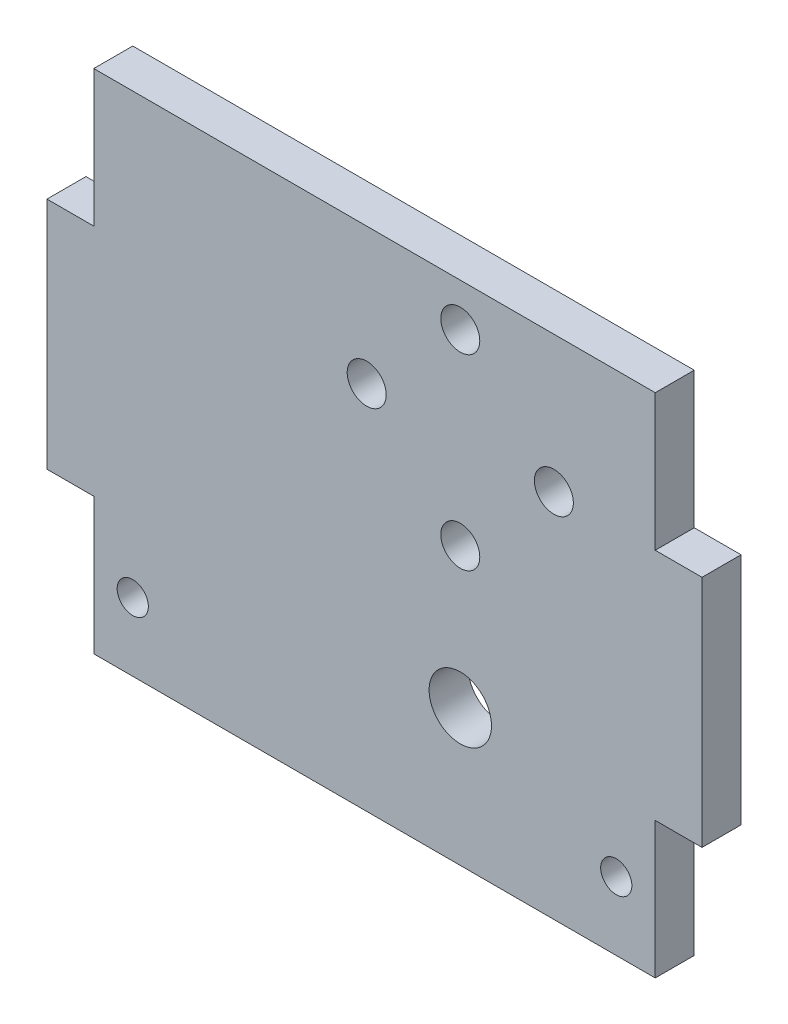
ISO-10303-21;
HEADER;
FILE_DESCRIPTION(('STEP AP214'),'2;1');
FILE_NAME('part.step','',(''),(''),'','','');
FILE_SCHEMA(('AUTOMOTIVE_DESIGN { 1 0 10303 214 1 1 1 1 }'));
ENDSEC;
DATA;
#1=APPLICATION_CONTEXT('core data for automotive mechanical design processes');
#2=APPLICATION_PROTOCOL_DEFINITION('international standard','automotive_design',2000,#1);
#3=PRODUCT_CONTEXT('',#1,'mechanical');
#4=PRODUCT('Part','Part','',(#3));
#5=PRODUCT_RELATED_PRODUCT_CATEGORY('part','',(#4));
#6=PRODUCT_DEFINITION_FORMATION('','',#4);
#7=PRODUCT_DEFINITION_CONTEXT('part definition',#1,'design');
#8=PRODUCT_DEFINITION('design','',#6,#7);
#9=PRODUCT_DEFINITION_SHAPE('','',#8);
#10=(LENGTH_UNIT() NAMED_UNIT(*) SI_UNIT(.MILLI.,.METRE.));
#11=(NAMED_UNIT(*) PLANE_ANGLE_UNIT() SI_UNIT($,.RADIAN.));
#12=(NAMED_UNIT(*) SI_UNIT($,.STERADIAN.) SOLID_ANGLE_UNIT());
#13=UNCERTAINTY_MEASURE_WITH_UNIT(LENGTH_MEASURE(1.E-05),#10,'distance_accuracy_value','');
#14=(GEOMETRIC_REPRESENTATION_CONTEXT(3) GLOBAL_UNCERTAINTY_ASSIGNED_CONTEXT((#13)) GLOBAL_UNIT_ASSIGNED_CONTEXT((#10,
#11,#12)) REPRESENTATION_CONTEXT('',''));
#15=CARTESIAN_POINT('',(0.,0.,0.));
#16=DIRECTION('',(0.,0.,1.));
#17=DIRECTION('',(1.,0.,0.));
#18=AXIS2_PLACEMENT_3D('',#15,#16,#17);
#19=CARTESIAN_POINT('',(0.,0.,5.));
#20=DIRECTION('',(0.,0.,-1.));
#21=DIRECTION('',(-1.,0.,0.));
#22=AXIS2_PLACEMENT_3D('',#19,#20,#21);
#23=PLANE('',#22);
#24=CARTESIAN_POINT('',(25.,59.5,5.));
#25=DIRECTION('',(0.,0.,1.));
#26=DIRECTION('',(1.,0.,0.));
#27=AXIS2_PLACEMENT_3D('',#24,#25,#26);
#28=CIRCLE('',#27,2.5);
#29=CARTESIAN_POINT('',(27.5,59.5,5.));
#30=VERTEX_POINT('',#29);
#31=EDGE_CURVE('E236',#30,#30,#28,.T.);
#32=ORIENTED_EDGE('',*,*,#31,.F.);
#33=EDGE_LOOP('',(#32));
#34=FACE_BOUND('',#33,.T.);
#35=CARTESIAN_POINT('',(25.,35.5,5.));
#36=DIRECTION('',(0.,0.,1.));
#37=DIRECTION('',(1.,0.,0.));
#38=AXIS2_PLACEMENT_3D('',#35,#36,#37);
#39=CIRCLE('',#38,2.5);
#40=CARTESIAN_POINT('',(27.5,35.5,5.));
#41=VERTEX_POINT('',#40);
#42=EDGE_CURVE('E467',#41,#41,#39,.T.);
#43=ORIENTED_EDGE('',*,*,#42,.F.);
#44=EDGE_LOOP('',(#43));
#45=FACE_BOUND('',#44,.T.);
#46=CARTESIAN_POINT('',(13.,47.5,5.));
#47=DIRECTION('',(0.,0.,1.));
#48=DIRECTION('',(1.,0.,0.));
#49=AXIS2_PLACEMENT_3D('',#46,#47,#48);
#50=CIRCLE('',#49,2.5);
#51=CARTESIAN_POINT('',(15.5,47.5,5.));
#52=VERTEX_POINT('',#51);
#53=EDGE_CURVE('E470',#52,#52,#50,.T.);
#54=ORIENTED_EDGE('',*,*,#53,.F.);
#55=EDGE_LOOP('',(#54));
#56=FACE_BOUND('',#55,.T.);
#57=CARTESIAN_POINT('',(37.,47.5,5.));
#58=DIRECTION('',(0.,0.,1.));
#59=DIRECTION('',(1.,0.,0.));
#60=AXIS2_PLACEMENT_3D('',#57,#58,#59);
#61=CIRCLE('',#60,2.5);
#62=CARTESIAN_POINT('',(39.5,47.5,5.));
#63=VERTEX_POINT('',#62);
#64=EDGE_CURVE('E474',#63,#63,#61,.T.);
#65=ORIENTED_EDGE('',*,*,#64,.F.);
#66=EDGE_LOOP('',(#65));
#67=FACE_BOUND('',#66,.T.);
#68=CARTESIAN_POINT('',(-17.,8.75,5.));
#69=DIRECTION('',(0.,0.,1.));
#70=DIRECTION('',(1.,0.,0.));
#71=AXIS2_PLACEMENT_3D('',#68,#69,#70);
#72=CIRCLE('',#71,2.);
#73=CARTESIAN_POINT('',(-15.,8.75,5.));
#74=VERTEX_POINT('',#73);
#75=EDGE_CURVE('E229',#74,#74,#72,.T.);
#76=ORIENTED_EDGE('',*,*,#75,.F.);
#77=EDGE_LOOP('',(#76));
#78=FACE_BOUND('',#77,.T.);
#79=CARTESIAN_POINT('',(45.,8.74999999999999,5.));
#80=DIRECTION('',(0.,0.,1.));
#81=DIRECTION('',(1.,0.,0.));
#82=AXIS2_PLACEMENT_3D('',#79,#80,#81);
#83=CIRCLE('',#82,2.);
#84=CARTESIAN_POINT('',(47.,8.74999999999999,5.));
#85=VERTEX_POINT('',#84);
#86=EDGE_CURVE('E243',#85,#85,#83,.T.);
#87=ORIENTED_EDGE('',*,*,#86,.F.);
#88=EDGE_LOOP('',(#87));
#89=FACE_BOUND('',#88,.T.);
#90=DIRECTION('',(-1.,0.,0.));
#91=VECTOR('',#90,1.);
#92=CARTESIAN_POINT('',(0.,65.,5.));
#93=LINE('',#92,#91);
#94=CARTESIAN_POINT('',(50.,65.,5.));
#95=VERTEX_POINT('',#94);
#96=CARTESIAN_POINT('',(-22.,65.,5.));
#97=VERTEX_POINT('',#96);
#98=EDGE_CURVE('E216',#95,#97,#93,.T.);
#99=ORIENTED_EDGE('',*,*,#98,.T.);
#100=DIRECTION('',(0.,-1.,0.));
#101=VECTOR('',#100,1.);
#102=CARTESIAN_POINT('',(-22.,65.,5.));
#103=LINE('',#102,#101);
#104=CARTESIAN_POINT('',(-22.,47.5,5.));
#105=VERTEX_POINT('',#104);
#106=EDGE_CURVE('E191',#97,#105,#103,.T.);
#107=ORIENTED_EDGE('',*,*,#106,.T.);
#108=DIRECTION('',(1.,0.,0.));
#109=VECTOR('',#108,1.);
#110=CARTESIAN_POINT('',(0.,47.5,5.));
#111=LINE('',#110,#109);
#112=CARTESIAN_POINT('',(-28.,47.5,5.));
#113=VERTEX_POINT('',#112);
#114=EDGE_CURVE('E173',#113,#105,#111,.T.);
#115=ORIENTED_EDGE('',*,*,#114,.F.);
#116=DIRECTION('',(0.,1.,0.));
#117=VECTOR('',#116,1.);
#118=CARTESIAN_POINT('',(-28.,0.,5.));
#119=LINE('',#118,#117);
#120=CARTESIAN_POINT('',(-28.,17.5,5.));
#121=VERTEX_POINT('',#120);
#122=EDGE_CURVE('E169',#121,#113,#119,.T.);
#123=ORIENTED_EDGE('',*,*,#122,.F.);
#124=DIRECTION('',(-1.,0.,0.));
#125=VECTOR('',#124,1.);
#126=CARTESIAN_POINT('',(0.,17.5,5.));
#127=LINE('',#126,#125);
#128=CARTESIAN_POINT('',(-22.,17.5,5.));
#129=VERTEX_POINT('',#128);
#130=EDGE_CURVE('E164',#129,#121,#127,.T.);
#131=ORIENTED_EDGE('',*,*,#130,.F.);
#132=CARTESIAN_POINT('',(-22.,0.,5.));
#133=VERTEX_POINT('',#132);
#134=EDGE_CURVE('E180',#129,#133,#103,.T.);
#135=ORIENTED_EDGE('',*,*,#134,.T.);
#136=DIRECTION('',(1.,0.,0.));
#137=VECTOR('',#136,1.);
#138=CARTESIAN_POINT('',(0.,0.,5.));
#139=LINE('',#138,#137);
#140=CARTESIAN_POINT('',(50.,0.,5.));
#141=VERTEX_POINT('',#140);
#142=EDGE_CURVE('E210',#133,#141,#139,.T.);
#143=ORIENTED_EDGE('',*,*,#142,.T.);
#144=DIRECTION('',(0.,1.,0.));
#145=VECTOR('',#144,1.);
#146=CARTESIAN_POINT('',(50.,0.,5.));
#147=LINE('',#146,#145);
#148=CARTESIAN_POINT('',(50.,17.5,5.));
#149=VERTEX_POINT('',#148);
#150=EDGE_CURVE('E214',#141,#149,#147,.T.);
#151=ORIENTED_EDGE('',*,*,#150,.T.);
#152=DIRECTION('',(1.,0.,0.));
#153=VECTOR('',#152,1.);
#154=CARTESIAN_POINT('',(0.,17.5,5.));
#155=LINE('',#154,#153);
#156=CARTESIAN_POINT('',(56.,17.5,5.));
#157=VERTEX_POINT('',#156);
#158=EDGE_CURVE('E157',#149,#157,#155,.T.);
#159=ORIENTED_EDGE('',*,*,#158,.T.);
#160=DIRECTION('',(0.,1.,0.));
#161=VECTOR('',#160,1.);
#162=CARTESIAN_POINT('',(56.,0.,5.));
#163=LINE('',#162,#161);
#164=CARTESIAN_POINT('',(56.,47.5,5.));
#165=VERTEX_POINT('',#164);
#166=EDGE_CURVE('E145',#157,#165,#163,.T.);
#167=ORIENTED_EDGE('',*,*,#166,.T.);
#168=DIRECTION('',(-1.,0.,0.));
#169=VECTOR('',#168,1.);
#170=CARTESIAN_POINT('',(0.,47.5,5.));
#171=LINE('',#170,#169);
#172=CARTESIAN_POINT('',(50.,47.5,5.));
#173=VERTEX_POINT('',#172);
#174=EDGE_CURVE('E151',#165,#173,#171,.T.);
#175=ORIENTED_EDGE('',*,*,#174,.T.);
#176=EDGE_CURVE('E212',#173,#95,#147,.T.);
#177=ORIENTED_EDGE('',*,*,#176,.T.);
#178=EDGE_LOOP('',(#99,#107,#115,#123,#131,#135,#143,#151,#159,#167,#175,#177));
#179=FACE_BOUND('',#178,.T.);
#180=CARTESIAN_POINT('',(25.,17.5,5.));
#181=DIRECTION('',(0.,0.,1.));
#182=DIRECTION('',(1.,0.,0.));
#183=AXIS2_PLACEMENT_3D('',#180,#181,#182);
#184=CIRCLE('',#183,4.);
#185=CARTESIAN_POINT('',(29.,17.5,5.));
#186=VERTEX_POINT('',#185);
#187=EDGE_CURVE('E204',#186,#186,#184,.T.);
#188=ORIENTED_EDGE('',*,*,#187,.F.);
#189=EDGE_LOOP('',(#188));
#190=FACE_BOUND('',#189,.T.);
#191=ADVANCED_FACE('F36',(#34,#45,#56,#67,#78,#89,#179,#190),#23,.F.);
#192=CARTESIAN_POINT('',(0.,0.,0.));
#193=DIRECTION('',(0.,0.,-1.));
#194=DIRECTION('',(-1.,0.,0.));
#195=AXIS2_PLACEMENT_3D('',#192,#193,#194);
#196=PLANE('',#195);
#197=CARTESIAN_POINT('',(25.,59.5,0.));
#198=DIRECTION('',(0.,0.,-1.));
#199=DIRECTION('',(-1.,0.,0.));
#200=AXIS2_PLACEMENT_3D('',#197,#198,#199);
#201=CIRCLE('',#200,2.5);
#202=CARTESIAN_POINT('',(22.5,59.5,0.));
#203=VERTEX_POINT('',#202);
#204=EDGE_CURVE('E40',#203,#203,#201,.T.);
#205=ORIENTED_EDGE('',*,*,#204,.F.);
#206=EDGE_LOOP('',(#205));
#207=FACE_BOUND('',#206,.T.);
#208=CARTESIAN_POINT('',(25.,35.5,0.));
#209=DIRECTION('',(0.,0.,-1.));
#210=DIRECTION('',(-1.,0.,0.));
#211=AXIS2_PLACEMENT_3D('',#208,#209,#210);
#212=CIRCLE('',#211,2.5);
#213=CARTESIAN_POINT('',(22.5,35.5,0.));
#214=VERTEX_POINT('',#213);
#215=EDGE_CURVE('E238',#214,#214,#212,.T.);
#216=ORIENTED_EDGE('',*,*,#215,.F.);
#217=EDGE_LOOP('',(#216));
#218=FACE_BOUND('',#217,.T.);
#219=CARTESIAN_POINT('',(13.,47.5,0.));
#220=DIRECTION('',(0.,0.,-1.));
#221=DIRECTION('',(-1.,0.,0.));
#222=AXIS2_PLACEMENT_3D('',#219,#220,#221);
#223=CIRCLE('',#222,2.5);
#224=CARTESIAN_POINT('',(10.5,47.5,0.));
#225=VERTEX_POINT('',#224);
#226=EDGE_CURVE('E235',#225,#225,#223,.T.);
#227=ORIENTED_EDGE('',*,*,#226,.F.);
#228=EDGE_LOOP('',(#227));
#229=FACE_BOUND('',#228,.T.);
#230=CARTESIAN_POINT('',(37.,47.5,0.));
#231=DIRECTION('',(0.,0.,-1.));
#232=DIRECTION('',(-1.,0.,0.));
#233=AXIS2_PLACEMENT_3D('',#230,#231,#232);
#234=CIRCLE('',#233,2.5);
#235=CARTESIAN_POINT('',(34.5,47.5,0.));
#236=VERTEX_POINT('',#235);
#237=EDGE_CURVE('E232',#236,#236,#234,.T.);
#238=ORIENTED_EDGE('',*,*,#237,.F.);
#239=EDGE_LOOP('',(#238));
#240=FACE_BOUND('',#239,.T.);
#241=CARTESIAN_POINT('',(-17.,8.75,0.));
#242=DIRECTION('',(0.,0.,-1.));
#243=DIRECTION('',(-1.,0.,0.));
#244=AXIS2_PLACEMENT_3D('',#241,#242,#243);
#245=CIRCLE('',#244,2.);
#246=CARTESIAN_POINT('',(-19.,8.75,0.));
#247=VERTEX_POINT('',#246);
#248=EDGE_CURVE('E228',#247,#247,#245,.T.);
#249=ORIENTED_EDGE('',*,*,#248,.F.);
#250=EDGE_LOOP('',(#249));
#251=FACE_BOUND('',#250,.T.);
#252=CARTESIAN_POINT('',(45.,8.74999999999999,0.));
#253=DIRECTION('',(0.,0.,-1.));
#254=DIRECTION('',(-1.,0.,0.));
#255=AXIS2_PLACEMENT_3D('',#252,#253,#254);
#256=CIRCLE('',#255,2.);
#257=CARTESIAN_POINT('',(43.,8.74999999999999,0.));
#258=VERTEX_POINT('',#257);
#259=EDGE_CURVE('E225',#258,#258,#256,.T.);
#260=ORIENTED_EDGE('',*,*,#259,.F.);
#261=EDGE_LOOP('',(#260));
#262=FACE_BOUND('',#261,.T.);
#263=CARTESIAN_POINT('',(25.,17.5,0.));
#264=DIRECTION('',(0.,0.,1.));
#265=DIRECTION('',(1.,0.,0.));
#266=AXIS2_PLACEMENT_3D('',#263,#264,#265);
#267=CIRCLE('',#266,4.);
#268=CARTESIAN_POINT('',(29.,17.5,0.));
#269=VERTEX_POINT('',#268);
#270=EDGE_CURVE('E201',#269,#269,#267,.T.);
#271=ORIENTED_EDGE('',*,*,#270,.T.);
#272=EDGE_LOOP('',(#271));
#273=FACE_BOUND('',#272,.T.);
#274=DIRECTION('',(1.,0.,0.));
#275=VECTOR('',#274,1.);
#276=CARTESIAN_POINT('',(0.,0.,0.));
#277=LINE('',#276,#275);
#278=CARTESIAN_POINT('',(-22.,0.,0.));
#279=VERTEX_POINT('',#278);
#280=CARTESIAN_POINT('',(50.,0.,0.));
#281=VERTEX_POINT('',#280);
#282=EDGE_CURVE('E207',#279,#281,#277,.T.);
#283=ORIENTED_EDGE('',*,*,#282,.F.);
#284=DIRECTION('',(0.,-1.,0.));
#285=VECTOR('',#284,1.);
#286=CARTESIAN_POINT('',(-22.,65.,0.));
#287=LINE('',#286,#285);
#288=CARTESIAN_POINT('',(-22.,17.5,0.));
#289=VERTEX_POINT('',#288);
#290=EDGE_CURVE('E198',#289,#279,#287,.T.);
#291=ORIENTED_EDGE('',*,*,#290,.F.);
#292=DIRECTION('',(-1.,0.,0.));
#293=VECTOR('',#292,1.);
#294=CARTESIAN_POINT('',(0.,17.5,0.));
#295=LINE('',#294,#293);
#296=CARTESIAN_POINT('',(-28.,17.5,0.));
#297=VERTEX_POINT('',#296);
#298=EDGE_CURVE('E177',#289,#297,#295,.T.);
#299=ORIENTED_EDGE('',*,*,#298,.T.);
#300=DIRECTION('',(0.,1.,0.));
#301=VECTOR('',#300,1.);
#302=CARTESIAN_POINT('',(-28.,0.,0.));
#303=LINE('',#302,#301);
#304=CARTESIAN_POINT('',(-28.,47.5,0.));
#305=VERTEX_POINT('',#304);
#306=EDGE_CURVE('E172',#297,#305,#303,.T.);
#307=ORIENTED_EDGE('',*,*,#306,.T.);
#308=DIRECTION('',(1.,0.,0.));
#309=VECTOR('',#308,1.);
#310=CARTESIAN_POINT('',(0.,47.5,0.));
#311=LINE('',#310,#309);
#312=CARTESIAN_POINT('',(-22.,47.5,0.));
#313=VERTEX_POINT('',#312);
#314=EDGE_CURVE('E181',#305,#313,#311,.T.);
#315=ORIENTED_EDGE('',*,*,#314,.T.);
#316=CARTESIAN_POINT('',(-22.,65.,0.));
#317=VERTEX_POINT('',#316);
#318=EDGE_CURVE('E195',#317,#313,#287,.T.);
#319=ORIENTED_EDGE('',*,*,#318,.F.);
#320=DIRECTION('',(-1.,0.,0.));
#321=VECTOR('',#320,1.);
#322=CARTESIAN_POINT('',(0.,65.,0.));
#323=LINE('',#322,#321);
#324=CARTESIAN_POINT('',(50.,65.,0.));
#325=VERTEX_POINT('',#324);
#326=EDGE_CURVE('E213',#325,#317,#323,.T.);
#327=ORIENTED_EDGE('',*,*,#326,.F.);
#328=DIRECTION('',(0.,1.,0.));
#329=VECTOR('',#328,1.);
#330=CARTESIAN_POINT('',(50.,0.,0.));
#331=LINE('',#330,#329);
#332=CARTESIAN_POINT('',(50.,47.5,0.));
#333=VERTEX_POINT('',#332);
#334=EDGE_CURVE('E219',#333,#325,#331,.T.);
#335=ORIENTED_EDGE('',*,*,#334,.F.);
#336=DIRECTION('',(-1.,0.,0.));
#337=VECTOR('',#336,1.);
#338=CARTESIAN_POINT('',(0.,47.5,0.));
#339=LINE('',#338,#337);
#340=CARTESIAN_POINT('',(56.,47.5,0.));
#341=VERTEX_POINT('',#340);
#342=EDGE_CURVE('E136',#341,#333,#339,.T.);
#343=ORIENTED_EDGE('',*,*,#342,.F.);
#344=DIRECTION('',(0.,1.,0.));
#345=VECTOR('',#344,1.);
#346=CARTESIAN_POINT('',(56.,0.,0.));
#347=LINE('',#346,#345);
#348=CARTESIAN_POINT('',(56.,17.5,0.));
#349=VERTEX_POINT('',#348);
#350=EDGE_CURVE('E128',#349,#341,#347,.T.);
#351=ORIENTED_EDGE('',*,*,#350,.F.);
#352=DIRECTION('',(1.,0.,0.));
#353=VECTOR('',#352,1.);
#354=CARTESIAN_POINT('',(0.,17.5,0.));
#355=LINE('',#354,#353);
#356=CARTESIAN_POINT('',(50.,17.5,0.));
#357=VERTEX_POINT('',#356);
#358=EDGE_CURVE('E134',#357,#349,#355,.T.);
#359=ORIENTED_EDGE('',*,*,#358,.F.);
#360=EDGE_CURVE('E220',#281,#357,#331,.T.);
#361=ORIENTED_EDGE('',*,*,#360,.F.);
#362=EDGE_LOOP('',(#283,#291,#299,#307,#315,#319,#327,#335,#343,#351,#359,#361));
#363=FACE_BOUND('',#362,.T.);
#364=ADVANCED_FACE('F131',(#207,#218,#229,#240,#251,#262,#273,#363),#196,.T.);
#365=CARTESIAN_POINT('',(50.,0.,5.));
#366=DIRECTION('',(-1.,0.,0.));
#367=DIRECTION('',(0.,0.,1.));
#368=AXIS2_PLACEMENT_3D('',#365,#366,#367);
#369=PLANE('',#368);
#370=DIRECTION('',(0.,0.,1.));
#371=VECTOR('',#370,1.);
#372=CARTESIAN_POINT('',(50.,47.5,-30.5941170815567));
#373=LINE('',#372,#371);
#374=EDGE_CURVE('E61',#333,#173,#373,.T.);
#375=ORIENTED_EDGE('',*,*,#374,.F.);
#376=ORIENTED_EDGE('',*,*,#334,.T.);
#377=DIRECTION('',(0.,0.,-1.));
#378=VECTOR('',#377,1.);
#379=CARTESIAN_POINT('',(50.,65.,5.));
#380=LINE('',#379,#378);
#381=EDGE_CURVE('E45',#95,#325,#380,.T.);
#382=ORIENTED_EDGE('',*,*,#381,.F.);
#383=ORIENTED_EDGE('',*,*,#176,.F.);
#384=EDGE_LOOP('',(#375,#376,#382,#383));
#385=FACE_BOUND('',#384,.T.);
#386=ADVANCED_FACE('F307',(#385),#369,.F.);
#387=CARTESIAN_POINT('',(-22.,65.,-65.00769185258));
#388=DIRECTION('',(-1.,0.,0.));
#389=DIRECTION('',(0.,0.,1.));
#390=AXIS2_PLACEMENT_3D('',#387,#388,#389);
#391=PLANE('',#390);
#392=ORIENTED_EDGE('',*,*,#318,.T.);
#393=DIRECTION('',(0.,0.,1.));
#394=VECTOR('',#393,1.);
#395=CARTESIAN_POINT('',(-22.,47.5,-30.5941170815567));
#396=LINE('',#395,#394);
#397=EDGE_CURVE('E176',#313,#105,#396,.T.);
#398=ORIENTED_EDGE('',*,*,#397,.T.);
#399=ORIENTED_EDGE('',*,*,#106,.F.);
#400=DIRECTION('',(0.,0.,1.));
#401=VECTOR('',#400,1.);
#402=CARTESIAN_POINT('',(-22.,65.,-65.00769185258));
#403=LINE('',#402,#401);
#404=EDGE_CURVE('E194',#317,#97,#403,.T.);
#405=ORIENTED_EDGE('',*,*,#404,.F.);
#406=EDGE_LOOP('',(#392,#398,#399,#405));
#407=FACE_BOUND('',#406,.T.);
#408=ADVANCED_FACE('F282',(#407),#391,.T.);
#409=CARTESIAN_POINT('',(0.,0.,5.));
#410=DIRECTION('',(0.,1.,0.));
#411=DIRECTION('',(0.,0.,1.));
#412=AXIS2_PLACEMENT_3D('',#409,#410,#411);
#413=PLANE('',#412);
#414=ORIENTED_EDGE('',*,*,#282,.T.);
#415=DIRECTION('',(0.,0.,-1.));
#416=VECTOR('',#415,1.);
#417=CARTESIAN_POINT('',(50.,0.,5.));
#418=LINE('',#417,#416);
#419=EDGE_CURVE('E11',#141,#281,#418,.T.);
#420=ORIENTED_EDGE('',*,*,#419,.F.);
#421=ORIENTED_EDGE('',*,*,#142,.F.);
#422=DIRECTION('',(0.,0.,1.));
#423=VECTOR('',#422,1.);
#424=CARTESIAN_POINT('',(-22.,0.,-65.00769185258));
#425=LINE('',#424,#423);
#426=EDGE_CURVE('E197',#279,#133,#425,.T.);
#427=ORIENTED_EDGE('',*,*,#426,.F.);
#428=EDGE_LOOP('',(#414,#420,#421,#427));
#429=FACE_BOUND('',#428,.T.);
#430=ADVANCED_FACE('F38',(#429),#413,.F.);
#431=ORIENTED_EDGE('',*,*,#360,.T.);
#432=DIRECTION('',(0.,0.,1.));
#433=VECTOR('',#432,1.);
#434=CARTESIAN_POINT('',(50.,17.5,-30.5941170815567));
#435=LINE('',#434,#433);
#436=EDGE_CURVE('E53',#357,#149,#435,.T.);
#437=ORIENTED_EDGE('',*,*,#436,.T.);
#438=ORIENTED_EDGE('',*,*,#150,.F.);
#439=ORIENTED_EDGE('',*,*,#419,.T.);
#440=EDGE_LOOP('',(#431,#437,#438,#439));
#441=FACE_BOUND('',#440,.T.);
#442=ADVANCED_FACE('F258',(#441),#369,.F.);
#443=CARTESIAN_POINT('',(0.,65.,5.));
#444=DIRECTION('',(0.,-1.,0.));
#445=DIRECTION('',(0.,0.,-1.));
#446=AXIS2_PLACEMENT_3D('',#443,#444,#445);
#447=PLANE('',#446);
#448=ORIENTED_EDGE('',*,*,#326,.T.);
#449=ORIENTED_EDGE('',*,*,#404,.T.);
#450=ORIENTED_EDGE('',*,*,#98,.F.);
#451=ORIENTED_EDGE('',*,*,#381,.T.);
#452=EDGE_LOOP('',(#448,#449,#450,#451));
#453=FACE_BOUND('',#452,.T.);
#454=ADVANCED_FACE('F286',(#453),#447,.F.);
#455=CARTESIAN_POINT('',(25.,17.5,5.));
#456=DIRECTION('',(0.,0.,-1.));
#457=DIRECTION('',(-1.,0.,0.));
#458=AXIS2_PLACEMENT_3D('',#455,#456,#457);
#459=CYLINDRICAL_SURFACE('',#458,4.);
#460=ORIENTED_EDGE('',*,*,#187,.T.);
#461=EDGE_LOOP('',(#460));
#462=FACE_BOUND('',#461,.T.);
#463=ORIENTED_EDGE('',*,*,#270,.F.);
#464=EDGE_LOOP('',(#463));
#465=FACE_BOUND('',#464,.T.);
#466=ADVANCED_FACE('F313',(#462,#465),#459,.F.);
#467=DIRECTION('',(0.,0.,1.));
#468=VECTOR('',#467,1.);
#469=CARTESIAN_POINT('',(-22.,17.5,-30.5941170815567));
#470=LINE('',#469,#468);
#471=EDGE_CURVE('E168',#289,#129,#470,.T.);
#472=ORIENTED_EDGE('',*,*,#471,.F.);
#473=ORIENTED_EDGE('',*,*,#290,.T.);
#474=ORIENTED_EDGE('',*,*,#426,.T.);
#475=ORIENTED_EDGE('',*,*,#134,.F.);
#476=EDGE_LOOP('',(#472,#473,#474,#475));
#477=FACE_BOUND('',#476,.T.);
#478=ADVANCED_FACE('F264',(#477),#391,.T.);
#479=CARTESIAN_POINT('',(0.,47.5,-30.5941170815567));
#480=DIRECTION('',(0.,-1.,0.));
#481=DIRECTION('',(0.,0.,-1.));
#482=AXIS2_PLACEMENT_3D('',#479,#480,#481);
#483=PLANE('',#482);
#484=ORIENTED_EDGE('',*,*,#314,.F.);
#485=DIRECTION('',(0.,0.,1.));
#486=VECTOR('',#485,1.);
#487=CARTESIAN_POINT('',(-28.,47.5,-30.5941170815567));
#488=LINE('',#487,#486);
#489=EDGE_CURVE('E163',#305,#113,#488,.T.);
#490=ORIENTED_EDGE('',*,*,#489,.T.);
#491=ORIENTED_EDGE('',*,*,#114,.T.);
#492=ORIENTED_EDGE('',*,*,#397,.F.);
#493=EDGE_LOOP('',(#484,#490,#491,#492));
#494=FACE_BOUND('',#493,.T.);
#495=ADVANCED_FACE('F279',(#494),#483,.F.);
#496=CARTESIAN_POINT('',(0.,17.5,-30.5941170815567));
#497=DIRECTION('',(0.,1.,0.));
#498=DIRECTION('',(0.,0.,1.));
#499=AXIS2_PLACEMENT_3D('',#496,#497,#498);
#500=PLANE('',#499);
#501=ORIENTED_EDGE('',*,*,#298,.F.);
#502=ORIENTED_EDGE('',*,*,#471,.T.);
#503=ORIENTED_EDGE('',*,*,#130,.T.);
#504=DIRECTION('',(0.,0.,1.));
#505=VECTOR('',#504,1.);
#506=CARTESIAN_POINT('',(-28.,17.5,-30.5941170815567));
#507=LINE('',#506,#505);
#508=EDGE_CURVE('E167',#297,#121,#507,.T.);
#509=ORIENTED_EDGE('',*,*,#508,.F.);
#510=EDGE_LOOP('',(#501,#502,#503,#509));
#511=FACE_BOUND('',#510,.T.);
#512=ADVANCED_FACE('F267',(#511),#500,.F.);
#513=CARTESIAN_POINT('',(-28.,0.,-30.5941170815567));
#514=DIRECTION('',(1.,0.,0.));
#515=DIRECTION('',(0.,0.,-1.));
#516=AXIS2_PLACEMENT_3D('',#513,#514,#515);
#517=PLANE('',#516);
#518=ORIENTED_EDGE('',*,*,#306,.F.);
#519=ORIENTED_EDGE('',*,*,#508,.T.);
#520=ORIENTED_EDGE('',*,*,#122,.T.);
#521=ORIENTED_EDGE('',*,*,#489,.F.);
#522=EDGE_LOOP('',(#518,#519,#520,#521));
#523=FACE_BOUND('',#522,.T.);
#524=ADVANCED_FACE('F272',(#523),#517,.F.);
#525=CARTESIAN_POINT('',(0.,17.5,-30.5941170815567));
#526=DIRECTION('',(0.,-1.,0.));
#527=DIRECTION('',(0.,0.,-1.));
#528=AXIS2_PLACEMENT_3D('',#525,#526,#527);
#529=PLANE('',#528);
#530=ORIENTED_EDGE('',*,*,#436,.F.);
#531=ORIENTED_EDGE('',*,*,#358,.T.);
#532=DIRECTION('',(0.,0.,1.));
#533=VECTOR('',#532,1.);
#534=CARTESIAN_POINT('',(56.,17.5,-30.5941170815567));
#535=LINE('',#534,#533);
#536=EDGE_CURVE('E140',#349,#157,#535,.T.);
#537=ORIENTED_EDGE('',*,*,#536,.T.);
#538=ORIENTED_EDGE('',*,*,#158,.F.);
#539=EDGE_LOOP('',(#530,#531,#537,#538));
#540=FACE_BOUND('',#539,.T.);
#541=ADVANCED_FACE('F150',(#540),#529,.T.);
#542=CARTESIAN_POINT('',(56.,0.,-30.5941170815567));
#543=DIRECTION('',(1.,0.,0.));
#544=DIRECTION('',(0.,0.,-1.));
#545=AXIS2_PLACEMENT_3D('',#542,#543,#544);
#546=PLANE('',#545);
#547=ORIENTED_EDGE('',*,*,#536,.F.);
#548=ORIENTED_EDGE('',*,*,#350,.T.);
#549=DIRECTION('',(0.,0.,1.));
#550=VECTOR('',#549,1.);
#551=CARTESIAN_POINT('',(56.,47.5,-30.5941170815567));
#552=LINE('',#551,#550);
#553=EDGE_CURVE('E139',#341,#165,#552,.T.);
#554=ORIENTED_EDGE('',*,*,#553,.T.);
#555=ORIENTED_EDGE('',*,*,#166,.F.);
#556=EDGE_LOOP('',(#547,#548,#554,#555));
#557=FACE_BOUND('',#556,.T.);
#558=ADVANCED_FACE('F143',(#557),#546,.T.);
#559=CARTESIAN_POINT('',(0.,47.5,-30.5941170815567));
#560=DIRECTION('',(0.,1.,0.));
#561=DIRECTION('',(0.,0.,1.));
#562=AXIS2_PLACEMENT_3D('',#559,#560,#561);
#563=PLANE('',#562);
#564=ORIENTED_EDGE('',*,*,#553,.F.);
#565=ORIENTED_EDGE('',*,*,#342,.T.);
#566=ORIENTED_EDGE('',*,*,#374,.T.);
#567=ORIENTED_EDGE('',*,*,#174,.F.);
#568=EDGE_LOOP('',(#564,#565,#566,#567));
#569=FACE_BOUND('',#568,.T.);
#570=ADVANCED_FACE('F288',(#569),#563,.T.);
#571=CARTESIAN_POINT('',(45.,8.74999999999999,-5.));
#572=DIRECTION('',(0.,0.,1.));
#573=DIRECTION('',(1.,0.,0.));
#574=AXIS2_PLACEMENT_3D('',#571,#572,#573);
#575=CYLINDRICAL_SURFACE('',#574,2.);
#576=ORIENTED_EDGE('',*,*,#259,.T.);
#577=EDGE_LOOP('',(#576));
#578=FACE_BOUND('',#577,.T.);
#579=ORIENTED_EDGE('',*,*,#86,.T.);
#580=EDGE_LOOP('',(#579));
#581=FACE_BOUND('',#580,.T.);
#582=ADVANCED_FACE('F290',(#578,#581),#575,.F.);
#583=CARTESIAN_POINT('',(-17.,8.75,-5.));
#584=DIRECTION('',(0.,0.,1.));
#585=DIRECTION('',(1.,0.,0.));
#586=AXIS2_PLACEMENT_3D('',#583,#584,#585);
#587=CYLINDRICAL_SURFACE('',#586,2.);
#588=ORIENTED_EDGE('',*,*,#248,.T.);
#589=EDGE_LOOP('',(#588));
#590=FACE_BOUND('',#589,.T.);
#591=ORIENTED_EDGE('',*,*,#75,.T.);
#592=EDGE_LOOP('',(#591));
#593=FACE_BOUND('',#592,.T.);
#594=ADVANCED_FACE('F296',(#590,#593),#587,.F.);
#595=CARTESIAN_POINT('',(37.,47.5,-5.));
#596=DIRECTION('',(0.,0.,1.));
#597=DIRECTION('',(1.,0.,0.));
#598=AXIS2_PLACEMENT_3D('',#595,#596,#597);
#599=CYLINDRICAL_SURFACE('',#598,2.5);
#600=ORIENTED_EDGE('',*,*,#237,.T.);
#601=EDGE_LOOP('',(#600));
#602=FACE_BOUND('',#601,.T.);
#603=ORIENTED_EDGE('',*,*,#64,.T.);
#604=EDGE_LOOP('',(#603));
#605=FACE_BOUND('',#604,.T.);
#606=ADVANCED_FACE('F422',(#602,#605),#599,.F.);
#607=CARTESIAN_POINT('',(13.,47.5,-5.));
#608=DIRECTION('',(0.,0.,1.));
#609=DIRECTION('',(1.,0.,0.));
#610=AXIS2_PLACEMENT_3D('',#607,#608,#609);
#611=CYLINDRICAL_SURFACE('',#610,2.5);
#612=ORIENTED_EDGE('',*,*,#226,.T.);
#613=EDGE_LOOP('',(#612));
#614=FACE_BOUND('',#613,.T.);
#615=ORIENTED_EDGE('',*,*,#53,.T.);
#616=EDGE_LOOP('',(#615));
#617=FACE_BOUND('',#616,.T.);
#618=ADVANCED_FACE('F433',(#614,#617),#611,.F.);
#619=CARTESIAN_POINT('',(25.,35.5,-5.));
#620=DIRECTION('',(0.,0.,1.));
#621=DIRECTION('',(1.,0.,0.));
#622=AXIS2_PLACEMENT_3D('',#619,#620,#621);
#623=CYLINDRICAL_SURFACE('',#622,2.5);
#624=ORIENTED_EDGE('',*,*,#215,.T.);
#625=EDGE_LOOP('',(#624));
#626=FACE_BOUND('',#625,.T.);
#627=ORIENTED_EDGE('',*,*,#42,.T.);
#628=EDGE_LOOP('',(#627));
#629=FACE_BOUND('',#628,.T.);
#630=ADVANCED_FACE('F440',(#626,#629),#623,.F.);
#631=CARTESIAN_POINT('',(25.,59.5,-5.));
#632=DIRECTION('',(0.,0.,1.));
#633=DIRECTION('',(1.,0.,0.));
#634=AXIS2_PLACEMENT_3D('',#631,#632,#633);
#635=CYLINDRICAL_SURFACE('',#634,2.5);
#636=ORIENTED_EDGE('',*,*,#204,.T.);
#637=EDGE_LOOP('',(#636));
#638=FACE_BOUND('',#637,.T.);
#639=ORIENTED_EDGE('',*,*,#31,.T.);
#640=EDGE_LOOP('',(#639));
#641=FACE_BOUND('',#640,.T.);
#642=ADVANCED_FACE('F448',(#638,#641),#635,.F.);
#643=CLOSED_SHELL('',(#191,#364,#386,#408,#430,#442,#454,#466,#478,#495,#512,#524,#541,#558,
#570,#582,#594,#606,#618,#630,#642));
#644=MANIFOLD_SOLID_BREP('B2',#643);
#645=ADVANCED_BREP_SHAPE_REPRESENTATION('',(#18,#644),#14);
#646=SHAPE_DEFINITION_REPRESENTATION(#9,#645);
ENDSEC;
END-ISO-10303-21;
